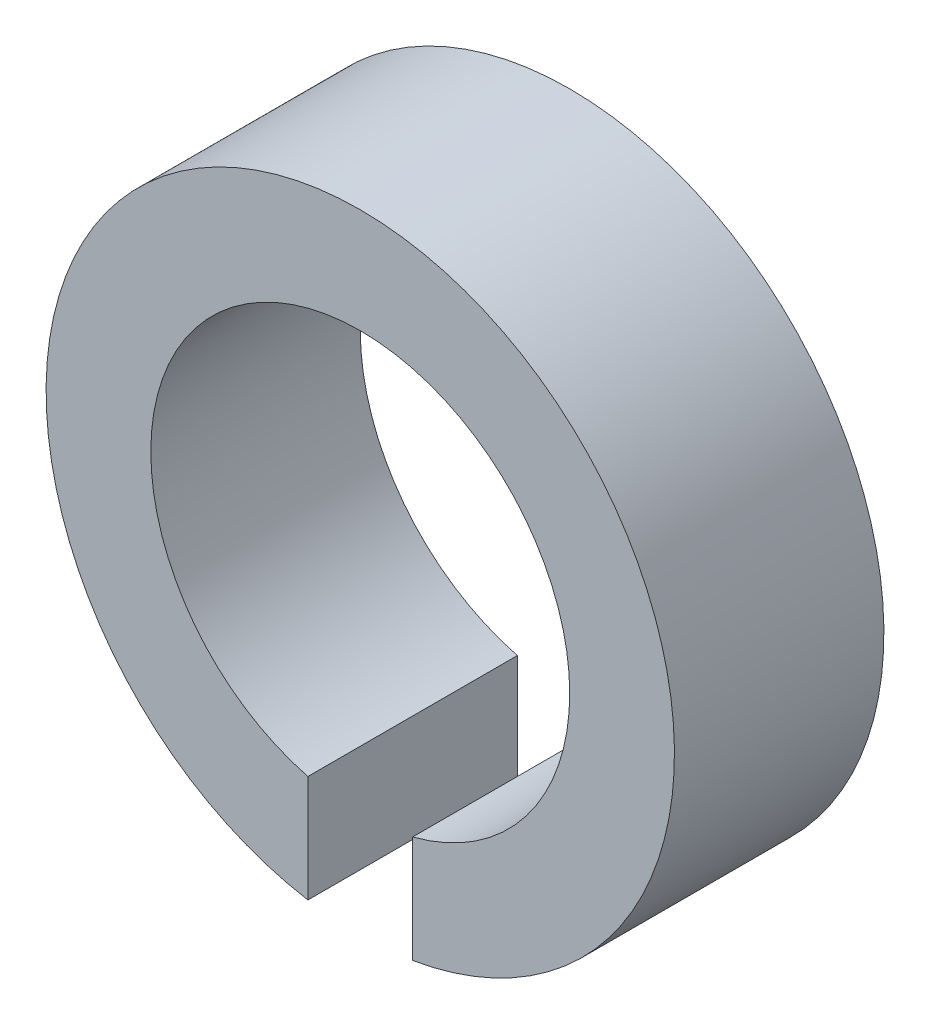
ISO-10303-21;
HEADER;
FILE_DESCRIPTION(('STEP AP214'),'2;1');
FILE_NAME('part.step','',(''),(''),'','','');
FILE_SCHEMA(('AUTOMOTIVE_DESIGN { 1 0 10303 214 1 1 1 1 }'));
ENDSEC;
DATA;
#1=APPLICATION_CONTEXT('core data for automotive mechanical design processes');
#2=APPLICATION_PROTOCOL_DEFINITION('international standard','automotive_design',2000,#1);
#3=PRODUCT_CONTEXT('',#1,'mechanical');
#4=PRODUCT('Part','Part','',(#3));
#5=PRODUCT_RELATED_PRODUCT_CATEGORY('part','',(#4));
#6=PRODUCT_DEFINITION_FORMATION('','',#4);
#7=PRODUCT_DEFINITION_CONTEXT('part definition',#1,'design');
#8=PRODUCT_DEFINITION('design','',#6,#7);
#9=PRODUCT_DEFINITION_SHAPE('','',#8);
#10=(LENGTH_UNIT() NAMED_UNIT(*) SI_UNIT(.MILLI.,.METRE.));
#11=(NAMED_UNIT(*) PLANE_ANGLE_UNIT() SI_UNIT($,.RADIAN.));
#12=(NAMED_UNIT(*) SI_UNIT($,.STERADIAN.) SOLID_ANGLE_UNIT());
#13=UNCERTAINTY_MEASURE_WITH_UNIT(LENGTH_MEASURE(1.E-05),#10,'distance_accuracy_value','');
#14=(GEOMETRIC_REPRESENTATION_CONTEXT(3) GLOBAL_UNCERTAINTY_ASSIGNED_CONTEXT((#13)) GLOBAL_UNIT_ASSIGNED_CONTEXT((#10,
#11,#12)) REPRESENTATION_CONTEXT('',''));
#15=CARTESIAN_POINT('',(0.,0.,0.));
#16=DIRECTION('',(0.,0.,1.));
#17=DIRECTION('',(1.,0.,0.));
#18=AXIS2_PLACEMENT_3D('',#15,#16,#17);
#19=CARTESIAN_POINT('',(0.,0.,6.));
#20=DIRECTION('',(0.,0.,-1.));
#21=DIRECTION('',(-1.,0.,0.));
#22=AXIS2_PLACEMENT_3D('',#19,#20,#21);
#23=CYLINDRICAL_SURFACE('',#22,6.);
#24=CARTESIAN_POINT('',(0.,0.,0.));
#25=DIRECTION('',(0.,0.,-1.));
#26=DIRECTION('',(1.,0.,0.));
#27=AXIS2_PLACEMENT_3D('',#24,#25,#26);
#28=CIRCLE('',#27,6.);
#29=CARTESIAN_POINT('',(-1.5,-5.80947501931113,0.));
#30=VERTEX_POINT('',#29);
#31=CARTESIAN_POINT('',(1.5,-5.80947501931113,0.));
#32=VERTEX_POINT('',#31);
#33=EDGE_CURVE('E75',#30,#32,#28,.T.);
#34=ORIENTED_EDGE('',*,*,#33,.T.);
#35=DIRECTION('',(0.,0.,-1.));
#36=VECTOR('',#35,1.);
#37=CARTESIAN_POINT('',(1.5,-5.80947501931113,6.));
#38=LINE('',#37,#36);
#39=CARTESIAN_POINT('',(1.5,-5.80947501931113,6.));
#40=VERTEX_POINT('',#39);
#41=EDGE_CURVE('E11',#40,#32,#38,.T.);
#42=ORIENTED_EDGE('',*,*,#41,.F.);
#43=CARTESIAN_POINT('',(0.,0.,6.));
#44=DIRECTION('',(0.,0.,-1.));
#45=DIRECTION('',(1.,0.,0.));
#46=AXIS2_PLACEMENT_3D('',#43,#44,#45);
#47=CIRCLE('',#46,6.);
#48=CARTESIAN_POINT('',(-1.5,-5.80947501931113,6.));
#49=VERTEX_POINT('',#48);
#50=EDGE_CURVE('E93',#49,#40,#47,.T.);
#51=ORIENTED_EDGE('',*,*,#50,.F.);
#52=DIRECTION('',(0.,0.,-1.));
#53=VECTOR('',#52,1.);
#54=CARTESIAN_POINT('',(-1.5,-5.80947501931113,6.));
#55=LINE('',#54,#53);
#56=EDGE_CURVE('E87',#49,#30,#55,.T.);
#57=ORIENTED_EDGE('',*,*,#56,.T.);
#58=EDGE_LOOP('',(#34,#42,#51,#57));
#59=FACE_BOUND('',#58,.T.);
#60=ADVANCED_FACE('F31',(#59),#23,.F.);
#61=CARTESIAN_POINT('',(1.5,-5.80947501931113,6.));
#62=DIRECTION('',(1.,0.,0.));
#63=DIRECTION('',(0.,1.,0.));
#64=AXIS2_PLACEMENT_3D('',#61,#62,#63);
#65=PLANE('',#64);
#66=DIRECTION('',(0.,-1.,0.));
#67=VECTOR('',#66,1.);
#68=CARTESIAN_POINT('',(1.5,-5.80947501931113,0.));
#69=LINE('',#68,#67);
#70=CARTESIAN_POINT('',(1.5,-8.87411967464942,0.));
#71=VERTEX_POINT('',#70);
#72=EDGE_CURVE('E71',#32,#71,#69,.T.);
#73=ORIENTED_EDGE('',*,*,#72,.T.);
#74=DIRECTION('',(0.,0.,-1.));
#75=VECTOR('',#74,1.);
#76=CARTESIAN_POINT('',(1.5,-8.87411967464942,6.));
#77=LINE('',#76,#75);
#78=CARTESIAN_POINT('',(1.5,-8.87411967464942,6.));
#79=VERTEX_POINT('',#78);
#80=EDGE_CURVE('E38',#79,#71,#77,.T.);
#81=ORIENTED_EDGE('',*,*,#80,.F.);
#82=DIRECTION('',(0.,-1.,0.));
#83=VECTOR('',#82,1.);
#84=CARTESIAN_POINT('',(1.5,-5.80947501931113,6.));
#85=LINE('',#84,#83);
#86=EDGE_CURVE('E83',#40,#79,#85,.T.);
#87=ORIENTED_EDGE('',*,*,#86,.F.);
#88=ORIENTED_EDGE('',*,*,#41,.T.);
#89=EDGE_LOOP('',(#73,#81,#87,#88));
#90=FACE_BOUND('',#89,.T.);
#91=ADVANCED_FACE('F82',(#90),#65,.F.);
#92=CARTESIAN_POINT('',(0.,0.,6.));
#93=DIRECTION('',(0.,0.,-1.));
#94=DIRECTION('',(-1.,0.,0.));
#95=AXIS2_PLACEMENT_3D('',#92,#93,#94);
#96=CYLINDRICAL_SURFACE('',#95,9.);
#97=CARTESIAN_POINT('',(0.,0.,0.));
#98=DIRECTION('',(0.,0.,1.));
#99=DIRECTION('',(1.,0.,0.));
#100=AXIS2_PLACEMENT_3D('',#97,#98,#99);
#101=CIRCLE('',#100,9.);
#102=CARTESIAN_POINT('',(-1.5,-8.87411967464942,0.));
#103=VERTEX_POINT('',#102);
#104=EDGE_CURVE('E76',#71,#103,#101,.T.);
#105=ORIENTED_EDGE('',*,*,#104,.T.);
#106=DIRECTION('',(0.,0.,-1.));
#107=VECTOR('',#106,1.);
#108=CARTESIAN_POINT('',(-1.5,-8.87411967464942,6.));
#109=LINE('',#108,#107);
#110=CARTESIAN_POINT('',(-1.5,-8.87411967464942,6.));
#111=VERTEX_POINT('',#110);
#112=EDGE_CURVE('E99',#111,#103,#109,.T.);
#113=ORIENTED_EDGE('',*,*,#112,.F.);
#114=CARTESIAN_POINT('',(0.,0.,6.));
#115=DIRECTION('',(0.,0.,1.));
#116=DIRECTION('',(1.,0.,0.));
#117=AXIS2_PLACEMENT_3D('',#114,#115,#116);
#118=CIRCLE('',#117,9.);
#119=EDGE_CURVE('E50',#79,#111,#118,.T.);
#120=ORIENTED_EDGE('',*,*,#119,.F.);
#121=ORIENTED_EDGE('',*,*,#80,.T.);
#122=EDGE_LOOP('',(#105,#113,#120,#121));
#123=FACE_BOUND('',#122,.T.);
#124=ADVANCED_FACE('F102',(#123),#96,.T.);
#125=CARTESIAN_POINT('',(-1.5,-5.80947501931113,6.));
#126=DIRECTION('',(-1.,0.,0.));
#127=DIRECTION('',(0.,0.,1.));
#128=AXIS2_PLACEMENT_3D('',#125,#126,#127);
#129=PLANE('',#128);
#130=DIRECTION('',(0.,1.,0.));
#131=VECTOR('',#130,1.);
#132=CARTESIAN_POINT('',(-1.5,-5.80947501931113,0.));
#133=LINE('',#132,#131);
#134=EDGE_CURVE('E91',#103,#30,#133,.T.);
#135=ORIENTED_EDGE('',*,*,#134,.T.);
#136=ORIENTED_EDGE('',*,*,#56,.F.);
#137=DIRECTION('',(0.,1.,0.));
#138=VECTOR('',#137,1.);
#139=CARTESIAN_POINT('',(-1.5,-5.80947501931113,6.));
#140=LINE('',#139,#138);
#141=EDGE_CURVE('E45',#111,#49,#140,.T.);
#142=ORIENTED_EDGE('',*,*,#141,.F.);
#143=ORIENTED_EDGE('',*,*,#112,.T.);
#144=EDGE_LOOP('',(#135,#136,#142,#143));
#145=FACE_BOUND('',#144,.T.);
#146=ADVANCED_FACE('F104',(#145),#129,.F.);
#147=CARTESIAN_POINT('',(0.,0.,6.));
#148=DIRECTION('',(0.,0.,1.));
#149=DIRECTION('',(1.,0.,0.));
#150=AXIS2_PLACEMENT_3D('',#147,#148,#149);
#151=PLANE('',#150);
#152=ORIENTED_EDGE('',*,*,#50,.T.);
#153=ORIENTED_EDGE('',*,*,#86,.T.);
#154=ORIENTED_EDGE('',*,*,#119,.T.);
#155=ORIENTED_EDGE('',*,*,#141,.T.);
#156=EDGE_LOOP('',(#152,#153,#154,#155));
#157=FACE_BOUND('',#156,.T.);
#158=ADVANCED_FACE('F105',(#157),#151,.T.);
#159=CARTESIAN_POINT('',(0.,0.,0.));
#160=DIRECTION('',(0.,0.,1.));
#161=DIRECTION('',(1.,0.,0.));
#162=AXIS2_PLACEMENT_3D('',#159,#160,#161);
#163=PLANE('',#162);
#164=ORIENTED_EDGE('',*,*,#33,.F.);
#165=ORIENTED_EDGE('',*,*,#134,.F.);
#166=ORIENTED_EDGE('',*,*,#104,.F.);
#167=ORIENTED_EDGE('',*,*,#72,.F.);
#168=EDGE_LOOP('',(#164,#165,#166,#167));
#169=FACE_BOUND('',#168,.T.);
#170=ADVANCED_FACE('F72',(#169),#163,.F.);
#171=CLOSED_SHELL('',(#60,#91,#124,#146,#158,#170));
#172=MANIFOLD_SOLID_BREP('B2',#171);
#173=ADVANCED_BREP_SHAPE_REPRESENTATION('',(#18,#172),#14);
#174=SHAPE_DEFINITION_REPRESENTATION(#9,#173);
ENDSEC;
END-ISO-10303-21;
